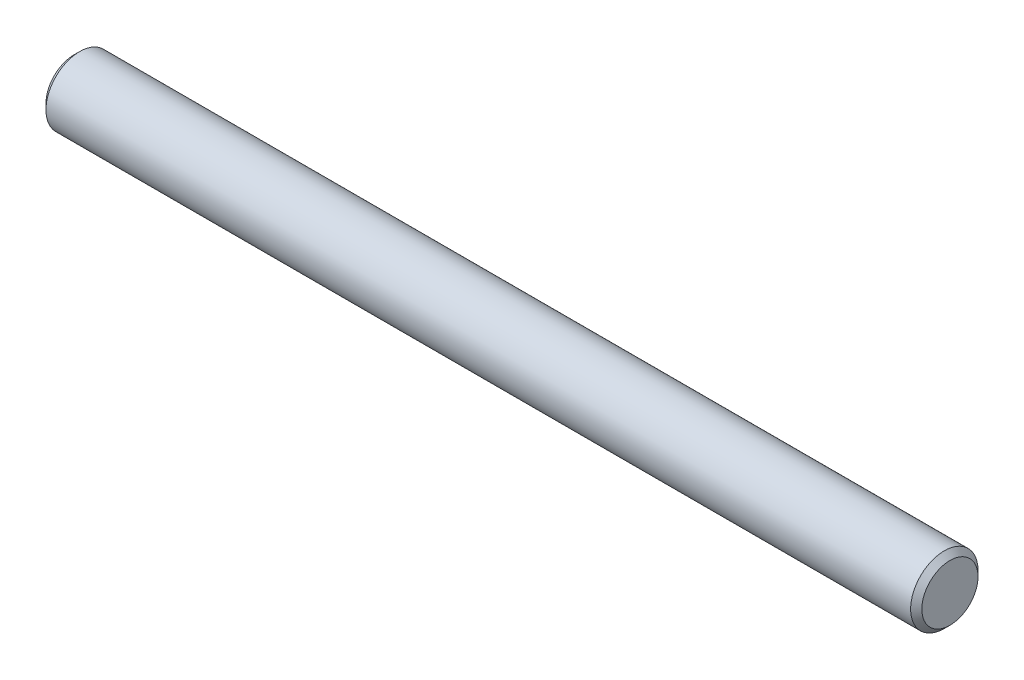
ISO-10303-21;
HEADER;
FILE_DESCRIPTION(('STEP AP214'),'2;1');
FILE_NAME('part.step','',(''),(''),'','','');
FILE_SCHEMA(('AUTOMOTIVE_DESIGN { 1 0 10303 214 1 1 1 1 }'));
ENDSEC;
DATA;
#1=APPLICATION_CONTEXT('core data for automotive mechanical design processes');
#2=APPLICATION_PROTOCOL_DEFINITION('international standard','automotive_design',2000,#1);
#3=PRODUCT_CONTEXT('',#1,'mechanical');
#4=PRODUCT('Part','Part','',(#3));
#5=PRODUCT_RELATED_PRODUCT_CATEGORY('part','',(#4));
#6=PRODUCT_DEFINITION_FORMATION('','',#4);
#7=PRODUCT_DEFINITION_CONTEXT('part definition',#1,'design');
#8=PRODUCT_DEFINITION('design','',#6,#7);
#9=PRODUCT_DEFINITION_SHAPE('','',#8);
#10=(LENGTH_UNIT() NAMED_UNIT(*) SI_UNIT(.MILLI.,.METRE.));
#11=(NAMED_UNIT(*) PLANE_ANGLE_UNIT() SI_UNIT($,.RADIAN.));
#12=(NAMED_UNIT(*) SI_UNIT($,.STERADIAN.) SOLID_ANGLE_UNIT());
#13=UNCERTAINTY_MEASURE_WITH_UNIT(LENGTH_MEASURE(1.E-05),#10,'distance_accuracy_value','');
#14=(GEOMETRIC_REPRESENTATION_CONTEXT(3) GLOBAL_UNCERTAINTY_ASSIGNED_CONTEXT((#13)) GLOBAL_UNIT_ASSIGNED_CONTEXT((#10,
#11,#12)) REPRESENTATION_CONTEXT('',''));
#15=CARTESIAN_POINT('',(0.,0.,0.));
#16=DIRECTION('',(0.,0.,1.));
#17=DIRECTION('',(1.,0.,0.));
#18=AXIS2_PLACEMENT_3D('',#15,#16,#17);
#19=CARTESIAN_POINT('',(39.,0.,0.));
#20=DIRECTION('',(-1.,0.,0.));
#21=DIRECTION('',(0.,0.,1.));
#22=AXIS2_PLACEMENT_3D('',#19,#20,#21);
#23=CYLINDRICAL_SURFACE('',#22,3.);
#24=CARTESIAN_POINT('',(-38.5,0.,0.));
#25=DIRECTION('',(1.,0.,0.));
#26=DIRECTION('',(0.,0.,-1.));
#27=AXIS2_PLACEMENT_3D('',#24,#25,#26);
#28=CIRCLE('',#27,3.);
#29=CARTESIAN_POINT('',(-38.5,0.,-3.));
#30=VERTEX_POINT('',#29);
#31=EDGE_CURVE('E42',#30,#30,#28,.T.);
#32=ORIENTED_EDGE('',*,*,#31,.T.);
#33=EDGE_LOOP('',(#32));
#34=FACE_BOUND('',#33,.T.);
#35=CARTESIAN_POINT('',(38.5,0.,0.));
#36=DIRECTION('',(1.,0.,0.));
#37=DIRECTION('',(0.,0.,-1.));
#38=AXIS2_PLACEMENT_3D('',#35,#36,#37);
#39=CIRCLE('',#38,3.);
#40=CARTESIAN_POINT('',(38.5,0.,-3.));
#41=VERTEX_POINT('',#40);
#42=EDGE_CURVE('E46',#41,#41,#39,.F.);
#43=ORIENTED_EDGE('',*,*,#42,.T.);
#44=EDGE_LOOP('',(#43));
#45=FACE_BOUND('',#44,.T.);
#46=ADVANCED_FACE('F31',(#34,#45),#23,.T.);
#47=CARTESIAN_POINT('',(39.,0.,0.));
#48=DIRECTION('',(1.,0.,0.));
#49=DIRECTION('',(0.,0.,-1.));
#50=AXIS2_PLACEMENT_3D('',#47,#48,#49);
#51=PLANE('',#50);
#52=CARTESIAN_POINT('',(39.,0.,0.));
#53=DIRECTION('',(1.,0.,0.));
#54=DIRECTION('',(0.,0.,-1.));
#55=AXIS2_PLACEMENT_3D('',#52,#53,#54);
#56=CIRCLE('',#55,2.5);
#57=CARTESIAN_POINT('',(39.,0.,-2.5));
#58=VERTEX_POINT('',#57);
#59=EDGE_CURVE('E10',#58,#58,#56,.T.);
#60=ORIENTED_EDGE('',*,*,#59,.T.);
#61=EDGE_LOOP('',(#60));
#62=FACE_BOUND('',#61,.T.);
#63=ADVANCED_FACE('F62',(#62),#51,.T.);
#64=CARTESIAN_POINT('',(-39.,0.,0.));
#65=DIRECTION('',(1.,0.,0.));
#66=DIRECTION('',(0.,0.,-1.));
#67=AXIS2_PLACEMENT_3D('',#64,#65,#66);
#68=PLANE('',#67);
#69=CARTESIAN_POINT('',(-39.,0.,0.));
#70=DIRECTION('',(1.,0.,0.));
#71=DIRECTION('',(0.,0.,-1.));
#72=AXIS2_PLACEMENT_3D('',#69,#70,#71);
#73=CIRCLE('',#72,2.50000000000003);
#74=CARTESIAN_POINT('',(-39.,0.,-2.50000000000003));
#75=VERTEX_POINT('',#74);
#76=EDGE_CURVE('E38',#75,#75,#73,.F.);
#77=ORIENTED_EDGE('',*,*,#76,.T.);
#78=EDGE_LOOP('',(#77));
#79=FACE_BOUND('',#78,.T.);
#80=ADVANCED_FACE('F59',(#79),#68,.F.);
#81=CARTESIAN_POINT('',(-38.5,0.,0.));
#82=DIRECTION('',(1.,0.,0.));
#83=DIRECTION('',(0.,0.,-1.));
#84=AXIS2_PLACEMENT_3D('',#81,#82,#83);
#85=CONICAL_SURFACE('',#84,3.,0.785398163397432);
#86=ORIENTED_EDGE('',*,*,#76,.F.);
#87=EDGE_LOOP('',(#86));
#88=FACE_BOUND('',#87,.T.);
#89=ORIENTED_EDGE('',*,*,#31,.F.);
#90=EDGE_LOOP('',(#89));
#91=FACE_BOUND('',#90,.T.);
#92=ADVANCED_FACE('F55',(#88,#91),#85,.T.);
#93=CARTESIAN_POINT('',(39.,0.,0.));
#94=DIRECTION('',(-1.,0.,0.));
#95=DIRECTION('',(0.,0.,1.));
#96=AXIS2_PLACEMENT_3D('',#93,#94,#95);
#97=CONICAL_SURFACE('',#96,2.5,0.785398163397446);
#98=ORIENTED_EDGE('',*,*,#42,.F.);
#99=EDGE_LOOP('',(#98));
#100=FACE_BOUND('',#99,.T.);
#101=ORIENTED_EDGE('',*,*,#59,.F.);
#102=EDGE_LOOP('',(#101));
#103=FACE_BOUND('',#102,.T.);
#104=ADVANCED_FACE('F33',(#100,#103),#97,.T.);
#105=CLOSED_SHELL('',(#46,#63,#80,#92,#104));
#106=MANIFOLD_SOLID_BREP('B2',#105);
#107=ADVANCED_BREP_SHAPE_REPRESENTATION('',(#18,#106),#14);
#108=SHAPE_DEFINITION_REPRESENTATION(#9,#107);
ENDSEC;
END-ISO-10303-21;
